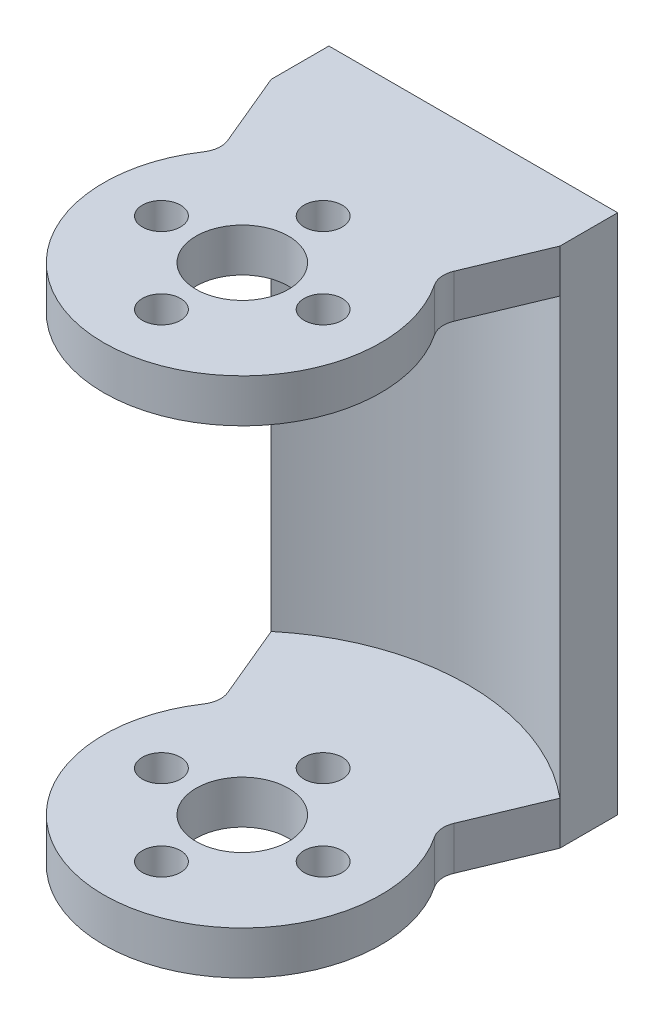
ISO-10303-21;
HEADER;
FILE_DESCRIPTION(('STEP AP214'),'2;1');
FILE_NAME('part.step','',(''),(''),'','','');
FILE_SCHEMA(('AUTOMOTIVE_DESIGN { 1 0 10303 214 1 1 1 1 }'));
ENDSEC;
DATA;
#1=APPLICATION_CONTEXT('core data for automotive mechanical design processes');
#2=APPLICATION_PROTOCOL_DEFINITION('international standard','automotive_design',2000,#1);
#3=PRODUCT_CONTEXT('',#1,'mechanical');
#4=PRODUCT('Part','Part','',(#3));
#5=PRODUCT_RELATED_PRODUCT_CATEGORY('part','',(#4));
#6=PRODUCT_DEFINITION_FORMATION('','',#4);
#7=PRODUCT_DEFINITION_CONTEXT('part definition',#1,'design');
#8=PRODUCT_DEFINITION('design','',#6,#7);
#9=PRODUCT_DEFINITION_SHAPE('','',#8);
#10=(LENGTH_UNIT() NAMED_UNIT(*) SI_UNIT(.MILLI.,.METRE.));
#11=(NAMED_UNIT(*) PLANE_ANGLE_UNIT() SI_UNIT($,.RADIAN.));
#12=(NAMED_UNIT(*) SI_UNIT($,.STERADIAN.) SOLID_ANGLE_UNIT());
#13=UNCERTAINTY_MEASURE_WITH_UNIT(LENGTH_MEASURE(1.E-05),#10,'distance_accuracy_value','');
#14=(GEOMETRIC_REPRESENTATION_CONTEXT(3) GLOBAL_UNCERTAINTY_ASSIGNED_CONTEXT((#13)) GLOBAL_UNIT_ASSIGNED_CONTEXT((#10,
#11,#12)) REPRESENTATION_CONTEXT('',''));
#15=CARTESIAN_POINT('',(0.,0.,0.));
#16=DIRECTION('',(0.,0.,1.));
#17=DIRECTION('',(1.,0.,0.));
#18=AXIS2_PLACEMENT_3D('',#15,#16,#17);
#19=CARTESIAN_POINT('',(-12.5,45.15,-15.));
#20=DIRECTION('',(0.922748853668887,0.,-0.385401807277489));
#21=DIRECTION('',(-0.385401807277489,0.,-0.922748853668887));
#22=AXIS2_PLACEMENT_3D('',#19,#20,#21);
#23=PLANE('',#22);
#24=DIRECTION('',(0.385401807277489,0.,0.922748853668887));
#25=VECTOR('',#24,1.);
#26=CARTESIAN_POINT('',(-12.5,0.,-15.));
#27=LINE('',#26,#25);
#28=CARTESIAN_POINT('',(-12.5,0.,-15.));
#29=VERTEX_POINT('',#28);
#30=CARTESIAN_POINT('',(-9.80151362124825,0.,-8.53914495050235));
#31=VERTEX_POINT('',#30);
#32=EDGE_CURVE('E327',#29,#31,#27,.T.);
#33=ORIENTED_EDGE('',*,*,#32,.T.);
#34=DIRECTION('',(0.,1.,0.));
#35=VECTOR('',#34,1.);
#36=CARTESIAN_POINT('',(-9.80151362124825,3.75,-8.53914495050235));
#37=LINE('',#36,#35);
#38=CARTESIAN_POINT('',(-9.80151362124825,3.75,-8.53914495050235));
#39=VERTEX_POINT('',#38);
#40=EDGE_CURVE('E58',#31,#39,#37,.T.);
#41=ORIENTED_EDGE('',*,*,#40,.T.);
#42=DIRECTION('',(-0.385401807277489,0.,-0.922748853668887));
#43=VECTOR('',#42,1.);
#44=CARTESIAN_POINT('',(-12.5,3.75,-15.));
#45=LINE('',#44,#43);
#46=CARTESIAN_POINT('',(-12.5,3.75,-15.));
#47=VERTEX_POINT('',#46);
#48=EDGE_CURVE('E356',#39,#47,#45,.T.);
#49=ORIENTED_EDGE('',*,*,#48,.T.);
#50=DIRECTION('',(0.,-1.,0.));
#51=VECTOR('',#50,1.);
#52=CARTESIAN_POINT('',(-12.5,45.15,-15.));
#53=LINE('',#52,#51);
#54=EDGE_CURVE('E175',#47,#29,#53,.T.);
#55=ORIENTED_EDGE('',*,*,#54,.T.);
#56=EDGE_LOOP('',(#33,#41,#49,#55));
#57=FACE_BOUND('',#56,.T.);
#58=ADVANCED_FACE('F39',(#57),#23,.F.);
#59=CARTESIAN_POINT('',(0.,45.15,0.));
#60=DIRECTION('',(0.,-1.,0.));
#61=DIRECTION('',(0.,0.,-1.));
#62=AXIS2_PLACEMENT_3D('',#59,#60,#61);
#63=CYLINDRICAL_SURFACE('',#62,12.);
#64=CARTESIAN_POINT('',(0.,0.,0.));
#65=DIRECTION('',(0.,1.,0.));
#66=DIRECTION('',(0.,0.,1.));
#67=AXIS2_PLACEMENT_3D('',#64,#65,#66);
#68=CIRCLE('',#67,12.);
#69=CARTESIAN_POINT('',(-9.98315256735945,0.,-6.6585782879549));
#70=VERTEX_POINT('',#69);
#71=CARTESIAN_POINT('',(9.98315256735945,0.,-6.6585782879549));
#72=VERTEX_POINT('',#71);
#73=EDGE_CURVE('E333',#70,#72,#68,.T.);
#74=ORIENTED_EDGE('',*,*,#73,.T.);
#75=DIRECTION('',(0.,-1.,0.));
#76=VECTOR('',#75,1.);
#77=CARTESIAN_POINT('',(9.98315256735945,45.15,-6.65857828795489));
#78=LINE('',#77,#76);
#79=CARTESIAN_POINT('',(9.98315256735945,3.75,-6.6585782879549));
#80=VERTEX_POINT('',#79);
#81=EDGE_CURVE('E230',#72,#80,#78,.F.);
#82=ORIENTED_EDGE('',*,*,#81,.T.);
#83=CARTESIAN_POINT('',(0.,3.75,0.));
#84=DIRECTION('',(0.,-1.,0.));
#85=DIRECTION('',(0.,0.,-1.));
#86=AXIS2_PLACEMENT_3D('',#83,#84,#85);
#87=CIRCLE('',#86,12.);
#88=CARTESIAN_POINT('',(-9.98315256735945,3.75,-6.6585782879549));
#89=VERTEX_POINT('',#88);
#90=EDGE_CURVE('E360',#80,#89,#87,.T.);
#91=ORIENTED_EDGE('',*,*,#90,.T.);
#92=DIRECTION('',(0.,-1.,0.));
#93=VECTOR('',#92,1.);
#94=CARTESIAN_POINT('',(-9.98315256735945,45.15,-6.65857828795489));
#95=LINE('',#94,#93);
#96=EDGE_CURVE('E221',#89,#70,#95,.T.);
#97=ORIENTED_EDGE('',*,*,#96,.T.);
#98=EDGE_LOOP('',(#74,#82,#91,#97));
#99=FACE_BOUND('',#98,.T.);
#100=ADVANCED_FACE('F271',(#99),#63,.T.);
#101=CARTESIAN_POINT('',(9.3674969975976,45.15,-7.5));
#102=DIRECTION('',(-0.922748853668887,0.,-0.385401807277489));
#103=DIRECTION('',(-0.385401807277489,0.,0.922748853668887));
#104=AXIS2_PLACEMENT_3D('',#101,#102,#103);
#105=PLANE('',#104);
#106=DIRECTION('',(-0.385401807277489,0.,0.922748853668887));
#107=VECTOR('',#106,1.);
#108=CARTESIAN_POINT('',(9.3674969975976,3.75,-7.5));
#109=LINE('',#108,#107);
#110=CARTESIAN_POINT('',(12.5,3.75,-15.));
#111=VERTEX_POINT('',#110);
#112=CARTESIAN_POINT('',(9.80151362124825,3.75,-8.53914495050235));
#113=VERTEX_POINT('',#112);
#114=EDGE_CURVE('E196',#111,#113,#109,.T.);
#115=ORIENTED_EDGE('',*,*,#114,.T.);
#116=DIRECTION('',(0.,1.,0.));
#117=VECTOR('',#116,1.);
#118=CARTESIAN_POINT('',(9.80151362124825,0.,-8.53914495050235));
#119=LINE('',#118,#117);
#120=CARTESIAN_POINT('',(9.80151362124825,0.,-8.53914495050235));
#121=VERTEX_POINT('',#120);
#122=EDGE_CURVE('E222',#113,#121,#119,.F.);
#123=ORIENTED_EDGE('',*,*,#122,.T.);
#124=DIRECTION('',(0.385401807277489,0.,-0.922748853668887));
#125=VECTOR('',#124,1.);
#126=CARTESIAN_POINT('',(9.3674969975976,0.,-7.5));
#127=LINE('',#126,#125);
#128=CARTESIAN_POINT('',(12.5,0.,-15.));
#129=VERTEX_POINT('',#128);
#130=EDGE_CURVE('E331',#121,#129,#127,.T.);
#131=ORIENTED_EDGE('',*,*,#130,.T.);
#132=DIRECTION('',(0.,-1.,0.));
#133=VECTOR('',#132,1.);
#134=CARTESIAN_POINT('',(12.5,45.15,-15.));
#135=LINE('',#134,#133);
#136=EDGE_CURVE('E318',#111,#129,#135,.T.);
#137=ORIENTED_EDGE('',*,*,#136,.F.);
#138=EDGE_LOOP('',(#115,#123,#131,#137));
#139=FACE_BOUND('',#138,.T.);
#140=ADVANCED_FACE('F280',(#139),#105,.F.);
#141=CARTESIAN_POINT('',(0.,45.15,0.));
#142=DIRECTION('',(0.,-1.,0.));
#143=DIRECTION('',(0.,0.,-1.));
#144=AXIS2_PLACEMENT_3D('',#141,#142,#143);
#145=CYLINDRICAL_SURFACE('',#144,4.);
#146=CARTESIAN_POINT('',(0.,3.75,0.));
#147=DIRECTION('',(0.,-1.,0.));
#148=DIRECTION('',(0.,0.,-1.));
#149=AXIS2_PLACEMENT_3D('',#146,#147,#148);
#150=CIRCLE('',#149,4.);
#151=CARTESIAN_POINT('',(0.,3.75,-4.));
#152=VERTEX_POINT('',#151);
#153=EDGE_CURVE('E164',#152,#152,#150,.T.);
#154=ORIENTED_EDGE('',*,*,#153,.F.);
#155=EDGE_LOOP('',(#154));
#156=FACE_BOUND('',#155,.T.);
#157=CARTESIAN_POINT('',(0.,0.,0.));
#158=DIRECTION('',(0.,1.,0.));
#159=DIRECTION('',(0.,0.,1.));
#160=AXIS2_PLACEMENT_3D('',#157,#158,#159);
#161=CIRCLE('',#160,4.);
#162=CARTESIAN_POINT('',(0.,0.,4.));
#163=VERTEX_POINT('',#162);
#164=EDGE_CURVE('E342',#163,#163,#161,.T.);
#165=ORIENTED_EDGE('',*,*,#164,.F.);
#166=EDGE_LOOP('',(#165));
#167=FACE_BOUND('',#166,.T.);
#168=ADVANCED_FACE('F372',(#156,#167),#145,.F.);
#169=CARTESIAN_POINT('',(0.,45.15,0.));
#170=DIRECTION('',(0.,1.,0.));
#171=DIRECTION('',(0.,0.,1.));
#172=AXIS2_PLACEMENT_3D('',#169,#170,#171);
#173=PLANE('',#172);
#174=CARTESIAN_POINT('',(7.,45.15,0.));
#175=DIRECTION('',(0.,1.,0.));
#176=DIRECTION('',(-1.,0.,0.));
#177=AXIS2_PLACEMENT_3D('',#174,#175,#176);
#178=CIRCLE('',#177,1.65);
#179=CARTESIAN_POINT('',(5.35,45.15,0.));
#180=VERTEX_POINT('',#179);
#181=EDGE_CURVE('E609',#180,#180,#178,.T.);
#182=ORIENTED_EDGE('',*,*,#181,.F.);
#183=EDGE_LOOP('',(#182));
#184=FACE_BOUND('',#183,.T.);
#185=CARTESIAN_POINT('',(0.,45.15,7.));
#186=DIRECTION('',(0.,1.,0.));
#187=DIRECTION('',(0.,0.,-1.));
#188=AXIS2_PLACEMENT_3D('',#185,#186,#187);
#189=CIRCLE('',#188,1.65);
#190=CARTESIAN_POINT('',(0.,45.15,5.35));
#191=VERTEX_POINT('',#190);
#192=EDGE_CURVE('E615',#191,#191,#189,.T.);
#193=ORIENTED_EDGE('',*,*,#192,.F.);
#194=EDGE_LOOP('',(#193));
#195=FACE_BOUND('',#194,.T.);
#196=CARTESIAN_POINT('',(-7.,45.15,0.));
#197=DIRECTION('',(0.,1.,0.));
#198=DIRECTION('',(1.,0.,0.));
#199=AXIS2_PLACEMENT_3D('',#196,#197,#198);
#200=CIRCLE('',#199,1.65);
#201=CARTESIAN_POINT('',(-5.35,45.15,0.));
#202=VERTEX_POINT('',#201);
#203=EDGE_CURVE('E148',#202,#202,#200,.T.);
#204=ORIENTED_EDGE('',*,*,#203,.F.);
#205=EDGE_LOOP('',(#204));
#206=FACE_BOUND('',#205,.T.);
#207=CARTESIAN_POINT('',(0.,45.15,-7.));
#208=DIRECTION('',(0.,1.,0.));
#209=DIRECTION('',(0.,0.,1.));
#210=AXIS2_PLACEMENT_3D('',#207,#208,#209);
#211=CIRCLE('',#210,1.65);
#212=CARTESIAN_POINT('',(0.,45.15,-5.35));
#213=VERTEX_POINT('',#212);
#214=EDGE_CURVE('E592',#213,#213,#211,.T.);
#215=ORIENTED_EDGE('',*,*,#214,.F.);
#216=EDGE_LOOP('',(#215));
#217=FACE_BOUND('',#216,.T.);
#218=DIRECTION('',(0.,0.,-1.));
#219=VECTOR('',#218,1.);
#220=CARTESIAN_POINT('',(12.5,45.15,-15.));
#221=LINE('',#220,#219);
#222=CARTESIAN_POINT('',(12.5,45.15,-15.));
#223=VERTEX_POINT('',#222);
#224=CARTESIAN_POINT('',(12.5,45.15,-20.));
#225=VERTEX_POINT('',#224);
#226=EDGE_CURVE('E335',#223,#225,#221,.T.);
#227=ORIENTED_EDGE('',*,*,#226,.T.);
#228=DIRECTION('',(-1.,0.,0.));
#229=VECTOR('',#228,1.);
#230=CARTESIAN_POINT('',(-12.5,45.15,-20.));
#231=LINE('',#230,#229);
#232=CARTESIAN_POINT('',(-12.5,45.15,-20.));
#233=VERTEX_POINT('',#232);
#234=EDGE_CURVE('E336',#225,#233,#231,.T.);
#235=ORIENTED_EDGE('',*,*,#234,.T.);
#236=DIRECTION('',(0.,0.,1.));
#237=VECTOR('',#236,1.);
#238=CARTESIAN_POINT('',(-12.5,45.15,-15.));
#239=LINE('',#238,#237);
#240=CARTESIAN_POINT('',(-12.5,45.15,-15.));
#241=VERTEX_POINT('',#240);
#242=EDGE_CURVE('E341',#233,#241,#239,.T.);
#243=ORIENTED_EDGE('',*,*,#242,.T.);
#244=DIRECTION('',(0.385401807277489,0.,0.922748853668887));
#245=VECTOR('',#244,1.);
#246=CARTESIAN_POINT('',(-12.5,45.15,-15.));
#247=LINE('',#246,#245);
#248=CARTESIAN_POINT('',(-9.80151362124825,45.15,-8.53914495050235));
#249=VERTEX_POINT('',#248);
#250=EDGE_CURVE('E180',#241,#249,#247,.T.);
#251=ORIENTED_EDGE('',*,*,#250,.T.);
#252=CARTESIAN_POINT('',(-11.647011328586,45.15,-7.76834133594738));
#253=DIRECTION('',(0.,1.,0.));
#254=DIRECTION('',(0.,0.,1.));
#255=AXIS2_PLACEMENT_3D('',#252,#253,#254);
#256=CIRCLE('',#255,2.);
#257=CARTESIAN_POINT('',(-9.98315256735945,45.15,-6.6585782879549));
#258=VERTEX_POINT('',#257);
#259=EDGE_CURVE('E243',#249,#258,#256,.F.);
#260=ORIENTED_EDGE('',*,*,#259,.T.);
#261=CARTESIAN_POINT('',(0.,45.15,0.));
#262=DIRECTION('',(0.,1.,0.));
#263=DIRECTION('',(0.,0.,1.));
#264=AXIS2_PLACEMENT_3D('',#261,#262,#263);
#265=CIRCLE('',#264,12.);
#266=CARTESIAN_POINT('',(9.98315256735945,45.15,-6.6585782879549));
#267=VERTEX_POINT('',#266);
#268=EDGE_CURVE('E246',#258,#267,#265,.T.);
#269=ORIENTED_EDGE('',*,*,#268,.T.);
#270=CARTESIAN_POINT('',(11.647011328586,45.15,-7.76834133594738));
#271=DIRECTION('',(0.,1.,0.));
#272=DIRECTION('',(0.,0.,1.));
#273=AXIS2_PLACEMENT_3D('',#270,#271,#272);
#274=CIRCLE('',#273,2.);
#275=CARTESIAN_POINT('',(9.80151362124825,45.15,-8.53914495050235));
#276=VERTEX_POINT('',#275);
#277=EDGE_CURVE('E234',#267,#276,#274,.F.);
#278=ORIENTED_EDGE('',*,*,#277,.T.);
#279=DIRECTION('',(0.385401807277489,0.,-0.922748853668887));
#280=VECTOR('',#279,1.);
#281=CARTESIAN_POINT('',(9.3674969975976,45.15,-7.5));
#282=LINE('',#281,#280);
#283=EDGE_CURVE('E257',#276,#223,#282,.T.);
#284=ORIENTED_EDGE('',*,*,#283,.T.);
#285=EDGE_LOOP('',(#227,#235,#243,#251,#260,#269,#278,#284));
#286=FACE_BOUND('',#285,.T.);
#287=CARTESIAN_POINT('',(0.,45.15,0.));
#288=DIRECTION('',(0.,1.,0.));
#289=DIRECTION('',(0.,0.,1.));
#290=AXIS2_PLACEMENT_3D('',#287,#288,#289);
#291=CIRCLE('',#290,4.);
#292=CARTESIAN_POINT('',(0.,45.15,4.));
#293=VERTEX_POINT('',#292);
#294=EDGE_CURVE('E323',#293,#293,#291,.T.);
#295=ORIENTED_EDGE('',*,*,#294,.F.);
#296=EDGE_LOOP('',(#295));
#297=FACE_BOUND('',#296,.T.);
#298=ADVANCED_FACE('F250',(#184,#195,#206,#217,#286,#297),#173,.T.);
#299=CARTESIAN_POINT('',(0.,0.,0.));
#300=DIRECTION('',(0.,1.,0.));
#301=DIRECTION('',(0.,0.,1.));
#302=AXIS2_PLACEMENT_3D('',#299,#300,#301);
#303=PLANE('',#302);
#304=CARTESIAN_POINT('',(7.,0.,0.));
#305=DIRECTION('',(0.,1.,0.));
#306=DIRECTION('',(-1.,0.,0.));
#307=AXIS2_PLACEMENT_3D('',#304,#305,#306);
#308=CIRCLE('',#307,1.65);
#309=CARTESIAN_POINT('',(5.35,0.,0.));
#310=VERTEX_POINT('',#309);
#311=EDGE_CURVE('E204',#310,#310,#308,.T.);
#312=ORIENTED_EDGE('',*,*,#311,.T.);
#313=EDGE_LOOP('',(#312));
#314=FACE_BOUND('',#313,.T.);
#315=CARTESIAN_POINT('',(0.,0.,7.));
#316=DIRECTION('',(0.,1.,0.));
#317=DIRECTION('',(0.,0.,-1.));
#318=AXIS2_PLACEMENT_3D('',#315,#316,#317);
#319=CIRCLE('',#318,1.65);
#320=CARTESIAN_POINT('',(0.,0.,5.35));
#321=VERTEX_POINT('',#320);
#322=EDGE_CURVE('E589',#321,#321,#319,.T.);
#323=ORIENTED_EDGE('',*,*,#322,.T.);
#324=EDGE_LOOP('',(#323));
#325=FACE_BOUND('',#324,.T.);
#326=CARTESIAN_POINT('',(-7.,0.,0.));
#327=DIRECTION('',(0.,1.,0.));
#328=DIRECTION('',(1.,0.,0.));
#329=AXIS2_PLACEMENT_3D('',#326,#327,#328);
#330=CIRCLE('',#329,1.65);
#331=CARTESIAN_POINT('',(-5.35,0.,0.));
#332=VERTEX_POINT('',#331);
#333=EDGE_CURVE('E587',#332,#332,#330,.T.);
#334=ORIENTED_EDGE('',*,*,#333,.T.);
#335=EDGE_LOOP('',(#334));
#336=FACE_BOUND('',#335,.T.);
#337=CARTESIAN_POINT('',(0.,0.,-7.));
#338=DIRECTION('',(0.,1.,0.));
#339=DIRECTION('',(0.,0.,1.));
#340=AXIS2_PLACEMENT_3D('',#337,#338,#339);
#341=CIRCLE('',#340,1.65);
#342=CARTESIAN_POINT('',(0.,0.,-5.35));
#343=VERTEX_POINT('',#342);
#344=EDGE_CURVE('E199',#343,#343,#341,.T.);
#345=ORIENTED_EDGE('',*,*,#344,.T.);
#346=EDGE_LOOP('',(#345));
#347=FACE_BOUND('',#346,.T.);
#348=DIRECTION('',(0.,0.,-1.));
#349=VECTOR('',#348,1.);
#350=CARTESIAN_POINT('',(12.5,0.,-15.));
#351=LINE('',#350,#349);
#352=CARTESIAN_POINT('',(12.5,0.,-20.));
#353=VERTEX_POINT('',#352);
#354=EDGE_CURVE('E322',#129,#353,#351,.T.);
#355=ORIENTED_EDGE('',*,*,#354,.F.);
#356=ORIENTED_EDGE('',*,*,#130,.F.);
#357=CARTESIAN_POINT('',(11.647011328586,0.,-7.76834133594738));
#358=DIRECTION('',(0.,1.,0.));
#359=DIRECTION('',(0.,0.,1.));
#360=AXIS2_PLACEMENT_3D('',#357,#358,#359);
#361=CIRCLE('',#360,2.);
#362=EDGE_CURVE('E239',#121,#72,#361,.T.);
#363=ORIENTED_EDGE('',*,*,#362,.T.);
#364=ORIENTED_EDGE('',*,*,#73,.F.);
#365=CARTESIAN_POINT('',(-11.647011328586,0.,-7.76834133594738));
#366=DIRECTION('',(0.,1.,0.));
#367=DIRECTION('',(0.,0.,1.));
#368=AXIS2_PLACEMENT_3D('',#365,#366,#367);
#369=CIRCLE('',#368,2.);
#370=EDGE_CURVE('E50',#70,#31,#369,.T.);
#371=ORIENTED_EDGE('',*,*,#370,.T.);
#372=ORIENTED_EDGE('',*,*,#32,.F.);
#373=DIRECTION('',(0.,0.,1.));
#374=VECTOR('',#373,1.);
#375=CARTESIAN_POINT('',(-12.5,0.,-15.));
#376=LINE('',#375,#374);
#377=CARTESIAN_POINT('',(-12.5,0.,-20.));
#378=VERTEX_POINT('',#377);
#379=EDGE_CURVE('E330',#378,#29,#376,.T.);
#380=ORIENTED_EDGE('',*,*,#379,.F.);
#381=DIRECTION('',(-1.,0.,0.));
#382=VECTOR('',#381,1.);
#383=CARTESIAN_POINT('',(-12.5,0.,-20.));
#384=LINE('',#383,#382);
#385=EDGE_CURVE('E321',#353,#378,#384,.T.);
#386=ORIENTED_EDGE('',*,*,#385,.F.);
#387=EDGE_LOOP('',(#355,#356,#363,#364,#371,#372,#380,#386));
#388=FACE_BOUND('',#387,.T.);
#389=ORIENTED_EDGE('',*,*,#164,.T.);
#390=EDGE_LOOP('',(#389));
#391=FACE_BOUND('',#390,.T.);
#392=ADVANCED_FACE('F299',(#314,#325,#336,#347,#388,#391),#303,.F.);
#393=CARTESIAN_POINT('',(12.5,45.15,-15.));
#394=DIRECTION('',(-1.,0.,0.));
#395=DIRECTION('',(0.,0.,1.));
#396=AXIS2_PLACEMENT_3D('',#393,#394,#395);
#397=PLANE('',#396);
#398=ORIENTED_EDGE('',*,*,#354,.T.);
#399=DIRECTION('',(0.,-1.,0.));
#400=VECTOR('',#399,1.);
#401=CARTESIAN_POINT('',(12.5,45.15,-20.));
#402=LINE('',#401,#400);
#403=EDGE_CURVE('E183',#225,#353,#402,.T.);
#404=ORIENTED_EDGE('',*,*,#403,.F.);
#405=ORIENTED_EDGE('',*,*,#226,.F.);
#406=CARTESIAN_POINT('',(12.5,41.4,-15.));
#407=VERTEX_POINT('',#406);
#408=EDGE_CURVE('E181',#223,#407,#135,.T.);
#409=ORIENTED_EDGE('',*,*,#408,.T.);
#410=DIRECTION('',(0.,-1.,0.));
#411=VECTOR('',#410,1.);
#412=CARTESIAN_POINT('',(12.5,3.75,-15.));
#413=LINE('',#412,#411);
#414=EDGE_CURVE('E147',#407,#111,#413,.T.);
#415=ORIENTED_EDGE('',*,*,#414,.T.);
#416=ORIENTED_EDGE('',*,*,#136,.T.);
#417=EDGE_LOOP('',(#398,#404,#405,#409,#415,#416));
#418=FACE_BOUND('',#417,.T.);
#419=ADVANCED_FACE('F292',(#418),#397,.F.);
#420=CARTESIAN_POINT('',(-12.5,45.15,-20.));
#421=DIRECTION('',(0.,0.,1.));
#422=DIRECTION('',(1.,0.,0.));
#423=AXIS2_PLACEMENT_3D('',#420,#421,#422);
#424=PLANE('',#423);
#425=ORIENTED_EDGE('',*,*,#385,.T.);
#426=DIRECTION('',(0.,-1.,0.));
#427=VECTOR('',#426,1.);
#428=CARTESIAN_POINT('',(-12.5,45.15,-20.));
#429=LINE('',#428,#427);
#430=EDGE_CURVE('E176',#233,#378,#429,.T.);
#431=ORIENTED_EDGE('',*,*,#430,.F.);
#432=ORIENTED_EDGE('',*,*,#234,.F.);
#433=ORIENTED_EDGE('',*,*,#403,.T.);
#434=EDGE_LOOP('',(#425,#431,#432,#433));
#435=FACE_BOUND('',#434,.T.);
#436=ADVANCED_FACE('F290',(#435),#424,.F.);
#437=CARTESIAN_POINT('',(-12.5,45.15,-15.));
#438=DIRECTION('',(1.,0.,0.));
#439=DIRECTION('',(0.,0.,-1.));
#440=AXIS2_PLACEMENT_3D('',#437,#438,#439);
#441=PLANE('',#440);
#442=ORIENTED_EDGE('',*,*,#379,.T.);
#443=ORIENTED_EDGE('',*,*,#54,.F.);
#444=DIRECTION('',(0.,-1.,0.));
#445=VECTOR('',#444,1.);
#446=CARTESIAN_POINT('',(-12.5,3.75,-15.));
#447=LINE('',#446,#445);
#448=CARTESIAN_POINT('',(-12.5,41.4,-15.));
#449=VERTEX_POINT('',#448);
#450=EDGE_CURVE('E142',#449,#47,#447,.T.);
#451=ORIENTED_EDGE('',*,*,#450,.F.);
#452=EDGE_CURVE('E166',#241,#449,#53,.T.);
#453=ORIENTED_EDGE('',*,*,#452,.F.);
#454=ORIENTED_EDGE('',*,*,#242,.F.);
#455=ORIENTED_EDGE('',*,*,#430,.T.);
#456=EDGE_LOOP('',(#442,#443,#451,#453,#454,#455));
#457=FACE_BOUND('',#456,.T.);
#458=ADVANCED_FACE('F167',(#457),#441,.F.);
#459=DIRECTION('',(0.385401807277489,0.,0.922748853668887));
#460=VECTOR('',#459,1.);
#461=CARTESIAN_POINT('',(-12.5,41.4,-15.));
#462=LINE('',#461,#460);
#463=CARTESIAN_POINT('',(-9.80151362124825,41.4,-8.53914495050235));
#464=VERTEX_POINT('',#463);
#465=EDGE_CURVE('E152',#449,#464,#462,.T.);
#466=ORIENTED_EDGE('',*,*,#465,.T.);
#467=DIRECTION('',(0.,1.,0.));
#468=VECTOR('',#467,1.);
#469=CARTESIAN_POINT('',(-9.80151362124825,45.15,-8.53914495050235));
#470=LINE('',#469,#468);
#471=EDGE_CURVE('E227',#464,#249,#470,.T.);
#472=ORIENTED_EDGE('',*,*,#471,.T.);
#473=ORIENTED_EDGE('',*,*,#250,.F.);
#474=ORIENTED_EDGE('',*,*,#452,.T.);
#475=EDGE_LOOP('',(#466,#472,#473,#474));
#476=FACE_BOUND('',#475,.T.);
#477=ADVANCED_FACE('F173',(#476),#23,.F.);
#478=CARTESIAN_POINT('',(0.,41.4,0.));
#479=DIRECTION('',(0.,1.,0.));
#480=DIRECTION('',(0.,0.,1.));
#481=AXIS2_PLACEMENT_3D('',#478,#479,#480);
#482=CIRCLE('',#481,12.);
#483=CARTESIAN_POINT('',(-9.98315256735945,41.4,-6.6585782879549));
#484=VERTEX_POINT('',#483);
#485=CARTESIAN_POINT('',(9.98315256735945,41.4,-6.6585782879549));
#486=VERTEX_POINT('',#485);
#487=EDGE_CURVE('E161',#484,#486,#482,.T.);
#488=ORIENTED_EDGE('',*,*,#487,.T.);
#489=DIRECTION('',(0.,-1.,0.));
#490=VECTOR('',#489,1.);
#491=CARTESIAN_POINT('',(9.98315256735945,45.15,-6.65857828795489));
#492=LINE('',#491,#490);
#493=EDGE_CURVE('E220',#486,#267,#492,.F.);
#494=ORIENTED_EDGE('',*,*,#493,.T.);
#495=ORIENTED_EDGE('',*,*,#268,.F.);
#496=DIRECTION('',(0.,-1.,0.));
#497=VECTOR('',#496,1.);
#498=CARTESIAN_POINT('',(-9.98315256735945,45.15,-6.65857828795489));
#499=LINE('',#498,#497);
#500=EDGE_CURVE('E218',#258,#484,#499,.T.);
#501=ORIENTED_EDGE('',*,*,#500,.T.);
#502=EDGE_LOOP('',(#488,#494,#495,#501));
#503=FACE_BOUND('',#502,.T.);
#504=ADVANCED_FACE('F254',(#503),#63,.T.);
#505=ORIENTED_EDGE('',*,*,#283,.F.);
#506=DIRECTION('',(0.,1.,0.));
#507=VECTOR('',#506,1.);
#508=CARTESIAN_POINT('',(9.80151362124825,41.4,-8.53914495050235));
#509=LINE('',#508,#507);
#510=CARTESIAN_POINT('',(9.80151362124825,41.4,-8.53914495050235));
#511=VERTEX_POINT('',#510);
#512=EDGE_CURVE('E189',#276,#511,#509,.F.);
#513=ORIENTED_EDGE('',*,*,#512,.T.);
#514=DIRECTION('',(0.385401807277489,0.,-0.922748853668887));
#515=VECTOR('',#514,1.);
#516=CARTESIAN_POINT('',(9.3674969975976,41.4,-7.5));
#517=LINE('',#516,#515);
#518=EDGE_CURVE('E193',#511,#407,#517,.T.);
#519=ORIENTED_EDGE('',*,*,#518,.T.);
#520=ORIENTED_EDGE('',*,*,#408,.F.);
#521=EDGE_LOOP('',(#505,#513,#519,#520));
#522=FACE_BOUND('',#521,.T.);
#523=ADVANCED_FACE('F286',(#522),#105,.F.);
#524=CARTESIAN_POINT('',(0.,41.4,0.));
#525=DIRECTION('',(0.,1.,0.));
#526=DIRECTION('',(0.,0.,1.));
#527=AXIS2_PLACEMENT_3D('',#524,#525,#526);
#528=CIRCLE('',#527,4.);
#529=CARTESIAN_POINT('',(0.,41.4,4.));
#530=VERTEX_POINT('',#529);
#531=EDGE_CURVE('E187',#530,#530,#528,.T.);
#532=ORIENTED_EDGE('',*,*,#531,.F.);
#533=EDGE_LOOP('',(#532));
#534=FACE_BOUND('',#533,.T.);
#535=ORIENTED_EDGE('',*,*,#294,.T.);
#536=EDGE_LOOP('',(#535));
#537=FACE_BOUND('',#536,.T.);
#538=ADVANCED_FACE('F373',(#534,#537),#145,.F.);
#539=CARTESIAN_POINT('',(12.5,3.75,25.));
#540=DIRECTION('',(0.,-1.,0.));
#541=DIRECTION('',(0.,0.,-1.));
#542=AXIS2_PLACEMENT_3D('',#539,#540,#541);
#543=PLANE('',#542);
#544=CARTESIAN_POINT('',(7.,3.75,0.));
#545=DIRECTION('',(0.,-1.,0.));
#546=DIRECTION('',(0.,0.,-1.));
#547=AXIS2_PLACEMENT_3D('',#544,#545,#546);
#548=CIRCLE('',#547,1.65);
#549=CARTESIAN_POINT('',(7.,3.75,-1.64999999999998));
#550=VERTEX_POINT('',#549);
#551=EDGE_CURVE('E215',#550,#550,#548,.T.);
#552=ORIENTED_EDGE('',*,*,#551,.T.);
#553=EDGE_LOOP('',(#552));
#554=FACE_BOUND('',#553,.T.);
#555=CARTESIAN_POINT('',(0.,3.75,7.));
#556=DIRECTION('',(0.,-1.,0.));
#557=DIRECTION('',(0.,0.,-1.));
#558=AXIS2_PLACEMENT_3D('',#555,#556,#557);
#559=CIRCLE('',#558,1.65);
#560=CARTESIAN_POINT('',(0.,3.75,5.35));
#561=VERTEX_POINT('',#560);
#562=EDGE_CURVE('E206',#561,#561,#559,.T.);
#563=ORIENTED_EDGE('',*,*,#562,.T.);
#564=EDGE_LOOP('',(#563));
#565=FACE_BOUND('',#564,.T.);
#566=CARTESIAN_POINT('',(-7.,3.75,0.));
#567=DIRECTION('',(0.,-1.,0.));
#568=DIRECTION('',(0.,0.,-1.));
#569=AXIS2_PLACEMENT_3D('',#566,#567,#568);
#570=CIRCLE('',#569,1.65);
#571=CARTESIAN_POINT('',(-7.,3.75,-1.65000000000007));
#572=VERTEX_POINT('',#571);
#573=EDGE_CURVE('E203',#572,#572,#570,.T.);
#574=ORIENTED_EDGE('',*,*,#573,.T.);
#575=EDGE_LOOP('',(#574));
#576=FACE_BOUND('',#575,.T.);
#577=CARTESIAN_POINT('',(0.,3.75,-7.));
#578=DIRECTION('',(0.,-1.,0.));
#579=DIRECTION('',(0.,0.,-1.));
#580=AXIS2_PLACEMENT_3D('',#577,#578,#579);
#581=CIRCLE('',#580,1.65);
#582=CARTESIAN_POINT('',(0.,3.75,-8.65));
#583=VERTEX_POINT('',#582);
#584=EDGE_CURVE('E174',#583,#583,#581,.T.);
#585=ORIENTED_EDGE('',*,*,#584,.T.);
#586=EDGE_LOOP('',(#585));
#587=FACE_BOUND('',#586,.T.);
#588=ORIENTED_EDGE('',*,*,#153,.T.);
#589=EDGE_LOOP('',(#588));
#590=FACE_BOUND('',#589,.T.);
#591=ORIENTED_EDGE('',*,*,#90,.F.);
#592=CARTESIAN_POINT('',(11.647011328586,3.75,-7.76834133594738));
#593=DIRECTION('',(0.,-1.,0.));
#594=DIRECTION('',(0.,0.,-1.));
#595=AXIS2_PLACEMENT_3D('',#592,#593,#594);
#596=CIRCLE('',#595,2.);
#597=EDGE_CURVE('E240',#80,#113,#596,.T.);
#598=ORIENTED_EDGE('',*,*,#597,.T.);
#599=ORIENTED_EDGE('',*,*,#114,.F.);
#600=CARTESIAN_POINT('',(0.,3.75,0.));
#601=DIRECTION('',(0.,1.,0.));
#602=DIRECTION('',(0.,0.,-1.));
#603=AXIS2_PLACEMENT_3D('',#600,#601,#602);
#604=CIRCLE('',#603,19.5256241897666);
#605=EDGE_CURVE('E153',#111,#47,#604,.T.);
#606=ORIENTED_EDGE('',*,*,#605,.T.);
#607=ORIENTED_EDGE('',*,*,#48,.F.);
#608=CARTESIAN_POINT('',(-11.647011328586,3.75,-7.76834133594738));
#609=DIRECTION('',(0.,-1.,0.));
#610=DIRECTION('',(0.,0.,-1.));
#611=AXIS2_PLACEMENT_3D('',#608,#609,#610);
#612=CIRCLE('',#611,2.);
#613=EDGE_CURVE('E11',#39,#89,#612,.T.);
#614=ORIENTED_EDGE('',*,*,#613,.T.);
#615=EDGE_LOOP('',(#591,#598,#599,#606,#607,#614));
#616=FACE_BOUND('',#615,.T.);
#617=ADVANCED_FACE('F357',(#554,#565,#576,#587,#590,#616),#543,.F.);
#618=CARTESIAN_POINT('',(12.5,41.4,25.));
#619=DIRECTION('',(0.,1.,0.));
#620=DIRECTION('',(0.,0.,1.));
#621=AXIS2_PLACEMENT_3D('',#618,#619,#620);
#622=PLANE('',#621);
#623=CARTESIAN_POINT('',(7.,41.4,0.));
#624=DIRECTION('',(0.,1.,0.));
#625=DIRECTION('',(0.,0.,1.));
#626=AXIS2_PLACEMENT_3D('',#623,#624,#625);
#627=CIRCLE('',#626,1.65);
#628=CARTESIAN_POINT('',(7.,41.4,1.65000000000002));
#629=VERTEX_POINT('',#628);
#630=EDGE_CURVE('E208',#629,#629,#627,.T.);
#631=ORIENTED_EDGE('',*,*,#630,.T.);
#632=EDGE_LOOP('',(#631));
#633=FACE_BOUND('',#632,.T.);
#634=CARTESIAN_POINT('',(0.,41.4,7.));
#635=DIRECTION('',(0.,1.,0.));
#636=DIRECTION('',(0.,0.,1.));
#637=AXIS2_PLACEMENT_3D('',#634,#635,#636);
#638=CIRCLE('',#637,1.65);
#639=CARTESIAN_POINT('',(0.,41.4,8.65));
#640=VERTEX_POINT('',#639);
#641=EDGE_CURVE('E207',#640,#640,#638,.T.);
#642=ORIENTED_EDGE('',*,*,#641,.T.);
#643=EDGE_LOOP('',(#642));
#644=FACE_BOUND('',#643,.T.);
#645=CARTESIAN_POINT('',(-7.,41.4,0.));
#646=DIRECTION('',(0.,1.,0.));
#647=DIRECTION('',(0.,0.,1.));
#648=AXIS2_PLACEMENT_3D('',#645,#646,#647);
#649=CIRCLE('',#648,1.65);
#650=CARTESIAN_POINT('',(-7.,41.4,1.64999999999993));
#651=VERTEX_POINT('',#650);
#652=EDGE_CURVE('E201',#651,#651,#649,.T.);
#653=ORIENTED_EDGE('',*,*,#652,.T.);
#654=EDGE_LOOP('',(#653));
#655=FACE_BOUND('',#654,.T.);
#656=CARTESIAN_POINT('',(0.,41.4,-7.));
#657=DIRECTION('',(0.,1.,0.));
#658=DIRECTION('',(0.,0.,1.));
#659=AXIS2_PLACEMENT_3D('',#656,#657,#658);
#660=CIRCLE('',#659,1.65);
#661=CARTESIAN_POINT('',(0.,41.4,-5.35));
#662=VERTEX_POINT('',#661);
#663=EDGE_CURVE('E200',#662,#662,#660,.T.);
#664=ORIENTED_EDGE('',*,*,#663,.T.);
#665=EDGE_LOOP('',(#664));
#666=FACE_BOUND('',#665,.T.);
#667=ORIENTED_EDGE('',*,*,#531,.T.);
#668=EDGE_LOOP('',(#667));
#669=FACE_BOUND('',#668,.T.);
#670=ORIENTED_EDGE('',*,*,#465,.F.);
#671=CARTESIAN_POINT('',(0.,41.4,0.));
#672=DIRECTION('',(0.,1.,0.));
#673=DIRECTION('',(0.,0.,1.));
#674=AXIS2_PLACEMENT_3D('',#671,#672,#673);
#675=CIRCLE('',#674,19.5256241897666);
#676=EDGE_CURVE('E138',#407,#449,#675,.T.);
#677=ORIENTED_EDGE('',*,*,#676,.F.);
#678=ORIENTED_EDGE('',*,*,#518,.F.);
#679=CARTESIAN_POINT('',(11.647011328586,41.4,-7.76834133594738));
#680=DIRECTION('',(0.,1.,0.));
#681=DIRECTION('',(0.,0.,1.));
#682=AXIS2_PLACEMENT_3D('',#679,#680,#681);
#683=CIRCLE('',#682,2.);
#684=EDGE_CURVE('E235',#511,#486,#683,.T.);
#685=ORIENTED_EDGE('',*,*,#684,.T.);
#686=ORIENTED_EDGE('',*,*,#487,.F.);
#687=CARTESIAN_POINT('',(-11.647011328586,41.4,-7.76834133594738));
#688=DIRECTION('',(0.,1.,0.));
#689=DIRECTION('',(0.,0.,1.));
#690=AXIS2_PLACEMENT_3D('',#687,#688,#689);
#691=CIRCLE('',#690,2.);
#692=EDGE_CURVE('E160',#484,#464,#691,.T.);
#693=ORIENTED_EDGE('',*,*,#692,.T.);
#694=EDGE_LOOP('',(#670,#677,#678,#685,#686,#693));
#695=FACE_BOUND('',#694,.T.);
#696=ADVANCED_FACE('F154',(#633,#644,#655,#666,#669,#695),#622,.F.);
#697=CARTESIAN_POINT('',(0.,0.,-7.));
#698=DIRECTION('',(0.,1.,0.));
#699=DIRECTION('',(0.,0.,1.));
#700=AXIS2_PLACEMENT_3D('',#697,#698,#699);
#701=CYLINDRICAL_SURFACE('',#700,1.65);
#702=ORIENTED_EDGE('',*,*,#214,.T.);
#703=EDGE_LOOP('',(#702));
#704=FACE_BOUND('',#703,.T.);
#705=ORIENTED_EDGE('',*,*,#663,.F.);
#706=EDGE_LOOP('',(#705));
#707=FACE_BOUND('',#706,.T.);
#708=ADVANCED_FACE('F391',(#704,#707),#701,.F.);
#709=ORIENTED_EDGE('',*,*,#344,.F.);
#710=EDGE_LOOP('',(#709));
#711=FACE_BOUND('',#710,.T.);
#712=ORIENTED_EDGE('',*,*,#584,.F.);
#713=EDGE_LOOP('',(#712));
#714=FACE_BOUND('',#713,.T.);
#715=ADVANCED_FACE('F398',(#711,#714),#701,.F.);
#716=CARTESIAN_POINT('',(-7.,0.,0.));
#717=DIRECTION('',(0.,1.,0.));
#718=DIRECTION('',(0.,0.,1.));
#719=AXIS2_PLACEMENT_3D('',#716,#717,#718);
#720=CYLINDRICAL_SURFACE('',#719,1.65);
#721=ORIENTED_EDGE('',*,*,#203,.T.);
#722=EDGE_LOOP('',(#721));
#723=FACE_BOUND('',#722,.T.);
#724=ORIENTED_EDGE('',*,*,#652,.F.);
#725=EDGE_LOOP('',(#724));
#726=FACE_BOUND('',#725,.T.);
#727=ADVANCED_FACE('F408',(#723,#726),#720,.F.);
#728=CARTESIAN_POINT('',(0.,0.,7.));
#729=DIRECTION('',(0.,1.,0.));
#730=DIRECTION('',(0.,0.,1.));
#731=AXIS2_PLACEMENT_3D('',#728,#729,#730);
#732=CYLINDRICAL_SURFACE('',#731,1.65);
#733=ORIENTED_EDGE('',*,*,#192,.T.);
#734=EDGE_LOOP('',(#733));
#735=FACE_BOUND('',#734,.T.);
#736=ORIENTED_EDGE('',*,*,#641,.F.);
#737=EDGE_LOOP('',(#736));
#738=FACE_BOUND('',#737,.T.);
#739=ADVANCED_FACE('F414',(#735,#738),#732,.F.);
#740=CARTESIAN_POINT('',(7.,0.,0.));
#741=DIRECTION('',(0.,1.,0.));
#742=DIRECTION('',(0.,0.,1.));
#743=AXIS2_PLACEMENT_3D('',#740,#741,#742);
#744=CYLINDRICAL_SURFACE('',#743,1.65);
#745=ORIENTED_EDGE('',*,*,#181,.T.);
#746=EDGE_LOOP('',(#745));
#747=FACE_BOUND('',#746,.T.);
#748=ORIENTED_EDGE('',*,*,#630,.F.);
#749=EDGE_LOOP('',(#748));
#750=FACE_BOUND('',#749,.T.);
#751=ADVANCED_FACE('F309',(#747,#750),#744,.F.);
#752=ORIENTED_EDGE('',*,*,#333,.F.);
#753=EDGE_LOOP('',(#752));
#754=FACE_BOUND('',#753,.T.);
#755=ORIENTED_EDGE('',*,*,#573,.F.);
#756=EDGE_LOOP('',(#755));
#757=FACE_BOUND('',#756,.T.);
#758=ADVANCED_FACE('F406',(#754,#757),#720,.F.);
#759=ORIENTED_EDGE('',*,*,#322,.F.);
#760=EDGE_LOOP('',(#759));
#761=FACE_BOUND('',#760,.T.);
#762=ORIENTED_EDGE('',*,*,#562,.F.);
#763=EDGE_LOOP('',(#762));
#764=FACE_BOUND('',#763,.T.);
#765=ADVANCED_FACE('F307',(#761,#764),#732,.F.);
#766=ORIENTED_EDGE('',*,*,#311,.F.);
#767=EDGE_LOOP('',(#766));
#768=FACE_BOUND('',#767,.T.);
#769=ORIENTED_EDGE('',*,*,#551,.F.);
#770=EDGE_LOOP('',(#769));
#771=FACE_BOUND('',#770,.T.);
#772=ADVANCED_FACE('F303',(#768,#771),#744,.F.);
#773=CARTESIAN_POINT('',(11.647011328586,45.15,-7.76834133594738));
#774=DIRECTION('',(0.,-1.,0.));
#775=DIRECTION('',(0.,0.,-1.));
#776=AXIS2_PLACEMENT_3D('',#773,#774,#775);
#777=CYLINDRICAL_SURFACE('',#776,2.);
#778=ORIENTED_EDGE('',*,*,#277,.F.);
#779=ORIENTED_EDGE('',*,*,#493,.F.);
#780=ORIENTED_EDGE('',*,*,#684,.F.);
#781=ORIENTED_EDGE('',*,*,#512,.F.);
#782=EDGE_LOOP('',(#778,#779,#780,#781));
#783=FACE_BOUND('',#782,.T.);
#784=ADVANCED_FACE('F270',(#783),#777,.F.);
#785=CARTESIAN_POINT('',(11.647011328586,45.15,-7.76834133594738));
#786=DIRECTION('',(0.,-1.,0.));
#787=DIRECTION('',(0.,0.,-1.));
#788=AXIS2_PLACEMENT_3D('',#785,#786,#787);
#789=CYLINDRICAL_SURFACE('',#788,2.);
#790=ORIENTED_EDGE('',*,*,#597,.F.);
#791=ORIENTED_EDGE('',*,*,#81,.F.);
#792=ORIENTED_EDGE('',*,*,#362,.F.);
#793=ORIENTED_EDGE('',*,*,#122,.F.);
#794=EDGE_LOOP('',(#790,#791,#792,#793));
#795=FACE_BOUND('',#794,.T.);
#796=ADVANCED_FACE('F263',(#795),#789,.F.);
#797=CARTESIAN_POINT('',(-11.647011328586,45.15,-7.76834133594738));
#798=DIRECTION('',(0.,-1.,0.));
#799=DIRECTION('',(0.,0.,-1.));
#800=AXIS2_PLACEMENT_3D('',#797,#798,#799);
#801=CYLINDRICAL_SURFACE('',#800,2.);
#802=ORIENTED_EDGE('',*,*,#259,.F.);
#803=ORIENTED_EDGE('',*,*,#471,.F.);
#804=ORIENTED_EDGE('',*,*,#692,.F.);
#805=ORIENTED_EDGE('',*,*,#500,.F.);
#806=EDGE_LOOP('',(#802,#803,#804,#805));
#807=FACE_BOUND('',#806,.T.);
#808=ADVANCED_FACE('F260',(#807),#801,.F.);
#809=CARTESIAN_POINT('',(-11.647011328586,45.15,-7.76834133594738));
#810=DIRECTION('',(0.,-1.,0.));
#811=DIRECTION('',(0.,0.,-1.));
#812=AXIS2_PLACEMENT_3D('',#809,#810,#811);
#813=CYLINDRICAL_SURFACE('',#812,2.);
#814=ORIENTED_EDGE('',*,*,#613,.F.);
#815=ORIENTED_EDGE('',*,*,#40,.F.);
#816=ORIENTED_EDGE('',*,*,#370,.F.);
#817=ORIENTED_EDGE('',*,*,#96,.F.);
#818=EDGE_LOOP('',(#814,#815,#816,#817));
#819=FACE_BOUND('',#818,.T.);
#820=ADVANCED_FACE('F41',(#819),#813,.F.);
#821=CARTESIAN_POINT('',(0.,66.8063235102405,0.));
#822=DIRECTION('',(0.,-1.,0.));
#823=DIRECTION('',(0.,0.,-1.));
#824=AXIS2_PLACEMENT_3D('',#821,#822,#823);
#825=CYLINDRICAL_SURFACE('',#824,19.5256241897666);
#826=ORIENTED_EDGE('',*,*,#676,.T.);
#827=ORIENTED_EDGE('',*,*,#450,.T.);
#828=ORIENTED_EDGE('',*,*,#605,.F.);
#829=ORIENTED_EDGE('',*,*,#414,.F.);
#830=EDGE_LOOP('',(#826,#827,#828,#829));
#831=FACE_BOUND('',#830,.T.);
#832=ADVANCED_FACE('F143',(#831),#825,.F.);
#833=CLOSED_SHELL('',(#58,#100,#140,#168,#298,#392,#419,#436,#458,#477,#504,#523,#538,#617,#696,
#708,#715,#727,#739,#751,#758,#765,#772,#784,#796,#808,#820,#832));
#834=MANIFOLD_SOLID_BREP('B2',#833);
#835=ADVANCED_BREP_SHAPE_REPRESENTATION('',(#18,#834),#14);
#836=SHAPE_DEFINITION_REPRESENTATION(#9,#835);
ENDSEC;
END-ISO-10303-21;
